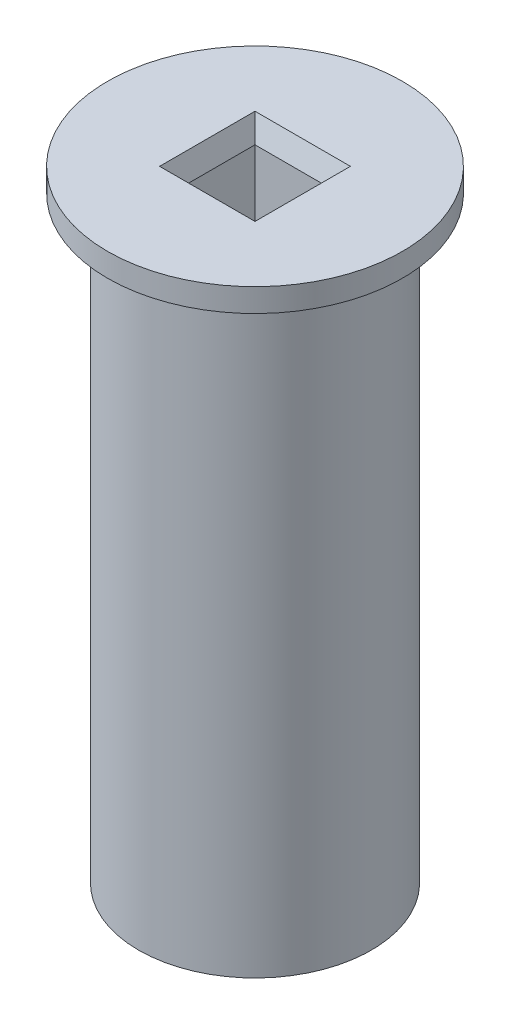
ISO-10303-21;
HEADER;
FILE_DESCRIPTION(('STEP AP214'),'2;1');
FILE_NAME('part.step','',(''),(''),'','','');
FILE_SCHEMA(('AUTOMOTIVE_DESIGN { 1 0 10303 214 1 1 1 1 }'));
ENDSEC;
DATA;
#1=APPLICATION_CONTEXT('core data for automotive mechanical design processes');
#2=APPLICATION_PROTOCOL_DEFINITION('international standard','automotive_design',2000,#1);
#3=PRODUCT_CONTEXT('',#1,'mechanical');
#4=PRODUCT('Part','Part','',(#3));
#5=PRODUCT_RELATED_PRODUCT_CATEGORY('part','',(#4));
#6=PRODUCT_DEFINITION_FORMATION('','',#4);
#7=PRODUCT_DEFINITION_CONTEXT('part definition',#1,'design');
#8=PRODUCT_DEFINITION('design','',#6,#7);
#9=PRODUCT_DEFINITION_SHAPE('','',#8);
#10=(LENGTH_UNIT() NAMED_UNIT(*) SI_UNIT(.MILLI.,.METRE.));
#11=(NAMED_UNIT(*) PLANE_ANGLE_UNIT() SI_UNIT($,.RADIAN.));
#12=(NAMED_UNIT(*) SI_UNIT($,.STERADIAN.) SOLID_ANGLE_UNIT());
#13=UNCERTAINTY_MEASURE_WITH_UNIT(LENGTH_MEASURE(1.E-05),#10,'distance_accuracy_value','');
#14=(GEOMETRIC_REPRESENTATION_CONTEXT(3) GLOBAL_UNCERTAINTY_ASSIGNED_CONTEXT((#13)) GLOBAL_UNIT_ASSIGNED_CONTEXT((#10,
#11,#12)) REPRESENTATION_CONTEXT('',''));
#15=CARTESIAN_POINT('',(0.,0.,0.));
#16=DIRECTION('',(0.,0.,1.));
#17=DIRECTION('',(1.,0.,0.));
#18=AXIS2_PLACEMENT_3D('',#15,#16,#17);
#19=CARTESIAN_POINT('',(0.,80.,0.));
#20=DIRECTION('',(0.,-1.,0.));
#21=DIRECTION('',(0.,0.,-1.));
#22=AXIS2_PLACEMENT_3D('',#19,#20,#21);
#23=CYLINDRICAL_SURFACE('',#22,15.);
#24=CARTESIAN_POINT('',(0.,0.,0.));
#25=DIRECTION('',(0.,1.,0.));
#26=DIRECTION('',(0.,0.,1.));
#27=AXIS2_PLACEMENT_3D('',#24,#25,#26);
#28=CIRCLE('',#27,15.);
#29=CARTESIAN_POINT('',(0.,0.,15.));
#30=VERTEX_POINT('',#29);
#31=EDGE_CURVE('E99',#30,#30,#28,.T.);
#32=ORIENTED_EDGE('',*,*,#31,.T.);
#33=EDGE_LOOP('',(#32));
#34=FACE_BOUND('',#33,.T.);
#35=CARTESIAN_POINT('',(0.,77.,0.));
#36=DIRECTION('',(0.,1.,0.));
#37=DIRECTION('',(0.,0.,1.));
#38=AXIS2_PLACEMENT_3D('',#35,#36,#37);
#39=CIRCLE('',#38,15.);
#40=CARTESIAN_POINT('',(0.,77.,15.));
#41=VERTEX_POINT('',#40);
#42=EDGE_CURVE('E121',#41,#41,#39,.T.);
#43=ORIENTED_EDGE('',*,*,#42,.F.);
#44=EDGE_LOOP('',(#43));
#45=FACE_BOUND('',#44,.T.);
#46=ADVANCED_FACE('F40',(#34,#45),#23,.T.);
#47=CARTESIAN_POINT('',(0.,80.,0.));
#48=DIRECTION('',(0.,1.,0.));
#49=DIRECTION('',(0.,0.,1.));
#50=AXIS2_PLACEMENT_3D('',#47,#48,#49);
#51=PLANE('',#50);
#52=DIRECTION('',(1.,0.,0.));
#53=VECTOR('',#52,1.);
#54=CARTESIAN_POINT('',(0.,80.,-6.14999999999999));
#55=LINE('',#54,#53);
#56=CARTESIAN_POINT('',(-6.14999999999999,80.,-6.14999999999999));
#57=VERTEX_POINT('',#56);
#58=CARTESIAN_POINT('',(6.15,80.,-6.14999999999999));
#59=VERTEX_POINT('',#58);
#60=EDGE_CURVE('E136',#57,#59,#55,.T.);
#61=ORIENTED_EDGE('',*,*,#60,.T.);
#62=DIRECTION('',(0.,0.,1.));
#63=VECTOR('',#62,1.);
#64=CARTESIAN_POINT('',(6.15,80.,0.));
#65=LINE('',#64,#63);
#66=CARTESIAN_POINT('',(6.15,80.,6.15));
#67=VERTEX_POINT('',#66);
#68=EDGE_CURVE('E142',#59,#67,#65,.T.);
#69=ORIENTED_EDGE('',*,*,#68,.T.);
#70=DIRECTION('',(-1.,0.,0.));
#71=VECTOR('',#70,1.);
#72=CARTESIAN_POINT('',(0.,80.,6.15));
#73=LINE('',#72,#71);
#74=CARTESIAN_POINT('',(-6.14999999999999,80.,6.15));
#75=VERTEX_POINT('',#74);
#76=EDGE_CURVE('E140',#67,#75,#73,.T.);
#77=ORIENTED_EDGE('',*,*,#76,.T.);
#78=DIRECTION('',(0.,0.,-1.));
#79=VECTOR('',#78,1.);
#80=CARTESIAN_POINT('',(-6.14999999999999,80.,0.));
#81=LINE('',#80,#79);
#82=EDGE_CURVE('E138',#75,#57,#81,.T.);
#83=ORIENTED_EDGE('',*,*,#82,.T.);
#84=EDGE_LOOP('',(#61,#69,#77,#83));
#85=FACE_BOUND('',#84,.T.);
#86=CARTESIAN_POINT('',(0.,80.,0.));
#87=DIRECTION('',(0.,1.,0.));
#88=DIRECTION('',(0.,0.,1.));
#89=AXIS2_PLACEMENT_3D('',#86,#87,#88);
#90=CIRCLE('',#89,19.);
#91=CARTESIAN_POINT('',(0.,80.,19.));
#92=VERTEX_POINT('',#91);
#93=EDGE_CURVE('E118',#92,#92,#90,.T.);
#94=ORIENTED_EDGE('',*,*,#93,.T.);
#95=EDGE_LOOP('',(#94));
#96=FACE_BOUND('',#95,.T.);
#97=ADVANCED_FACE('F163',(#85,#96),#51,.T.);
#98=CARTESIAN_POINT('',(0.,0.,0.));
#99=DIRECTION('',(0.,1.,0.));
#100=DIRECTION('',(0.,0.,1.));
#101=AXIS2_PLACEMENT_3D('',#98,#99,#100);
#102=PLANE('',#101);
#103=ORIENTED_EDGE('',*,*,#31,.F.);
#104=EDGE_LOOP('',(#103));
#105=FACE_BOUND('',#104,.T.);
#106=DIRECTION('',(0.,0.,1.));
#107=VECTOR('',#106,1.);
#108=CARTESIAN_POINT('',(-5.15,0.,5.15));
#109=LINE('',#108,#107);
#110=CARTESIAN_POINT('',(-5.15,0.,-5.15));
#111=VERTEX_POINT('',#110);
#112=CARTESIAN_POINT('',(-5.15,0.,5.15));
#113=VERTEX_POINT('',#112);
#114=EDGE_CURVE('E95',#111,#113,#109,.T.);
#115=ORIENTED_EDGE('',*,*,#114,.T.);
#116=DIRECTION('',(1.,0.,0.));
#117=VECTOR('',#116,1.);
#118=CARTESIAN_POINT('',(5.15,0.,5.15));
#119=LINE('',#118,#117);
#120=CARTESIAN_POINT('',(5.15,0.,5.15));
#121=VERTEX_POINT('',#120);
#122=EDGE_CURVE('E103',#113,#121,#119,.T.);
#123=ORIENTED_EDGE('',*,*,#122,.T.);
#124=DIRECTION('',(0.,0.,-1.));
#125=VECTOR('',#124,1.);
#126=CARTESIAN_POINT('',(5.15,0.,5.15));
#127=LINE('',#126,#125);
#128=CARTESIAN_POINT('',(5.15,0.,-5.15));
#129=VERTEX_POINT('',#128);
#130=EDGE_CURVE('E109',#121,#129,#127,.T.);
#131=ORIENTED_EDGE('',*,*,#130,.T.);
#132=DIRECTION('',(-1.,0.,0.));
#133=VECTOR('',#132,1.);
#134=CARTESIAN_POINT('',(5.15,0.,-5.15));
#135=LINE('',#134,#133);
#136=EDGE_CURVE('E113',#129,#111,#135,.T.);
#137=ORIENTED_EDGE('',*,*,#136,.T.);
#138=EDGE_LOOP('',(#115,#123,#131,#137));
#139=FACE_BOUND('',#138,.T.);
#140=ADVANCED_FACE('F111',(#105,#139),#102,.F.);
#141=CARTESIAN_POINT('',(-5.15,80.,5.15));
#142=DIRECTION('',(1.,0.,0.));
#143=DIRECTION('',(0.,0.,-1.));
#144=AXIS2_PLACEMENT_3D('',#141,#142,#143);
#145=PLANE('',#144);
#146=DIRECTION('',(0.,-1.,0.));
#147=VECTOR('',#146,1.);
#148=CARTESIAN_POINT('',(-5.15,80.,-5.15));
#149=LINE('',#148,#147);
#150=CARTESIAN_POINT('',(-5.15,77.2525225805454,-5.15));
#151=VERTEX_POINT('',#150);
#152=EDGE_CURVE('E126',#151,#111,#149,.T.);
#153=ORIENTED_EDGE('',*,*,#152,.F.);
#154=DIRECTION('',(0.,0.,1.));
#155=VECTOR('',#154,1.);
#156=CARTESIAN_POINT('',(-5.15,77.2525225805454,5.15));
#157=LINE('',#156,#155);
#158=CARTESIAN_POINT('',(-5.15,77.2525225805454,5.15));
#159=VERTEX_POINT('',#158);
#160=EDGE_CURVE('E49',#151,#159,#157,.T.);
#161=ORIENTED_EDGE('',*,*,#160,.T.);
#162=DIRECTION('',(0.,-1.,0.));
#163=VECTOR('',#162,1.);
#164=CARTESIAN_POINT('',(-5.15,80.,5.15));
#165=LINE('',#164,#163);
#166=EDGE_CURVE('E91',#159,#113,#165,.T.);
#167=ORIENTED_EDGE('',*,*,#166,.T.);
#168=ORIENTED_EDGE('',*,*,#114,.F.);
#169=EDGE_LOOP('',(#153,#161,#167,#168));
#170=FACE_BOUND('',#169,.T.);
#171=ADVANCED_FACE('F93',(#170),#145,.T.);
#172=CARTESIAN_POINT('',(5.15,80.,5.15));
#173=DIRECTION('',(0.,0.,-1.));
#174=DIRECTION('',(-1.,0.,0.));
#175=AXIS2_PLACEMENT_3D('',#172,#173,#174);
#176=PLANE('',#175);
#177=ORIENTED_EDGE('',*,*,#166,.F.);
#178=DIRECTION('',(1.,0.,0.));
#179=VECTOR('',#178,1.);
#180=CARTESIAN_POINT('',(5.15,77.2525225805454,5.15));
#181=LINE('',#180,#179);
#182=CARTESIAN_POINT('',(5.15,77.2525225805454,5.15));
#183=VERTEX_POINT('',#182);
#184=EDGE_CURVE('E145',#159,#183,#181,.T.);
#185=ORIENTED_EDGE('',*,*,#184,.T.);
#186=DIRECTION('',(0.,-1.,0.));
#187=VECTOR('',#186,1.);
#188=CARTESIAN_POINT('',(5.15,80.,5.15));
#189=LINE('',#188,#187);
#190=EDGE_CURVE('E100',#183,#121,#189,.T.);
#191=ORIENTED_EDGE('',*,*,#190,.T.);
#192=ORIENTED_EDGE('',*,*,#122,.F.);
#193=EDGE_LOOP('',(#177,#185,#191,#192));
#194=FACE_BOUND('',#193,.T.);
#195=ADVANCED_FACE('F104',(#194),#176,.T.);
#196=CARTESIAN_POINT('',(5.15,80.,5.15));
#197=DIRECTION('',(-1.,0.,0.));
#198=DIRECTION('',(0.,0.,1.));
#199=AXIS2_PLACEMENT_3D('',#196,#197,#198);
#200=PLANE('',#199);
#201=ORIENTED_EDGE('',*,*,#190,.F.);
#202=DIRECTION('',(0.,0.,-1.));
#203=VECTOR('',#202,1.);
#204=CARTESIAN_POINT('',(5.15,77.2525225805454,5.15));
#205=LINE('',#204,#203);
#206=CARTESIAN_POINT('',(5.15,77.2525225805454,-5.15));
#207=VERTEX_POINT('',#206);
#208=EDGE_CURVE('E133',#183,#207,#205,.T.);
#209=ORIENTED_EDGE('',*,*,#208,.T.);
#210=DIRECTION('',(0.,-1.,0.));
#211=VECTOR('',#210,1.);
#212=CARTESIAN_POINT('',(5.15,80.,-5.15));
#213=LINE('',#212,#211);
#214=EDGE_CURVE('E128',#207,#129,#213,.T.);
#215=ORIENTED_EDGE('',*,*,#214,.T.);
#216=ORIENTED_EDGE('',*,*,#130,.F.);
#217=EDGE_LOOP('',(#201,#209,#215,#216));
#218=FACE_BOUND('',#217,.T.);
#219=ADVANCED_FACE('F254',(#218),#200,.T.);
#220=CARTESIAN_POINT('',(5.15,80.,-5.15));
#221=DIRECTION('',(0.,0.,1.));
#222=DIRECTION('',(1.,0.,0.));
#223=AXIS2_PLACEMENT_3D('',#220,#221,#222);
#224=PLANE('',#223);
#225=ORIENTED_EDGE('',*,*,#214,.F.);
#226=DIRECTION('',(-1.,0.,0.));
#227=VECTOR('',#226,1.);
#228=CARTESIAN_POINT('',(5.15,77.2525225805454,-5.15));
#229=LINE('',#228,#227);
#230=EDGE_CURVE('E11',#207,#151,#229,.T.);
#231=ORIENTED_EDGE('',*,*,#230,.T.);
#232=ORIENTED_EDGE('',*,*,#152,.T.);
#233=ORIENTED_EDGE('',*,*,#136,.F.);
#234=EDGE_LOOP('',(#225,#231,#232,#233));
#235=FACE_BOUND('',#234,.T.);
#236=ADVANCED_FACE('F176',(#235),#224,.T.);
#237=CARTESIAN_POINT('',(0.,77.,0.));
#238=DIRECTION('',(0.,1.,0.));
#239=DIRECTION('',(0.,0.,1.));
#240=AXIS2_PLACEMENT_3D('',#237,#238,#239);
#241=PLANE('',#240);
#242=CARTESIAN_POINT('',(0.,77.,0.));
#243=DIRECTION('',(0.,1.,0.));
#244=DIRECTION('',(0.,0.,1.));
#245=AXIS2_PLACEMENT_3D('',#242,#243,#244);
#246=CIRCLE('',#245,19.);
#247=CARTESIAN_POINT('',(0.,77.,19.));
#248=VERTEX_POINT('',#247);
#249=EDGE_CURVE('E114',#248,#248,#246,.T.);
#250=ORIENTED_EDGE('',*,*,#249,.F.);
#251=EDGE_LOOP('',(#250));
#252=FACE_BOUND('',#251,.T.);
#253=ORIENTED_EDGE('',*,*,#42,.T.);
#254=EDGE_LOOP('',(#253));
#255=FACE_BOUND('',#254,.T.);
#256=ADVANCED_FACE('F167',(#252,#255),#241,.F.);
#257=CARTESIAN_POINT('',(0.,77.,0.));
#258=DIRECTION('',(0.,1.,0.));
#259=DIRECTION('',(0.,0.,1.));
#260=AXIS2_PLACEMENT_3D('',#257,#258,#259);
#261=CYLINDRICAL_SURFACE('',#260,19.);
#262=ORIENTED_EDGE('',*,*,#249,.T.);
#263=EDGE_LOOP('',(#262));
#264=FACE_BOUND('',#263,.T.);
#265=ORIENTED_EDGE('',*,*,#93,.F.);
#266=EDGE_LOOP('',(#265));
#267=FACE_BOUND('',#266,.T.);
#268=ADVANCED_FACE('F165',(#264,#267),#261,.T.);
#269=CARTESIAN_POINT('',(-5.15,77.2525225805454,5.15));
#270=DIRECTION('',(-0.939692620785909,-0.342020143325667,0.));
#271=DIRECTION('',(0.,0.,1.));
#272=AXIS2_PLACEMENT_3D('',#269,#270,#271);
#273=PLANE('',#272);
#274=DIRECTION('',(0.323615577118183,-0.889126490715989,0.323615577118183));
#275=VECTOR('',#274,1.);
#276=CARTESIAN_POINT('',(-4.07131146993859,74.2888502015769,-4.07131146993859));
#277=LINE('',#276,#275);
#278=EDGE_CURVE('E151',#57,#151,#277,.T.);
#279=ORIENTED_EDGE('',*,*,#278,.F.);
#280=ORIENTED_EDGE('',*,*,#82,.F.);
#281=DIRECTION('',(0.323615577118183,-0.889126490715989,-0.323615577118183));
#282=VECTOR('',#281,1.);
#283=CARTESIAN_POINT('',(-4.07131146993859,74.2888502015769,4.07131146993859));
#284=LINE('',#283,#282);
#285=EDGE_CURVE('E44',#159,#75,#284,.F.);
#286=ORIENTED_EDGE('',*,*,#285,.F.);
#287=ORIENTED_EDGE('',*,*,#160,.F.);
#288=EDGE_LOOP('',(#279,#280,#286,#287));
#289=FACE_BOUND('',#288,.T.);
#290=ADVANCED_FACE('F42',(#289),#273,.F.);
#291=CARTESIAN_POINT('',(5.15,77.2525225805454,5.15));
#292=DIRECTION('',(0.,-0.342020143325667,0.939692620785909));
#293=DIRECTION('',(1.,0.,0.));
#294=AXIS2_PLACEMENT_3D('',#291,#292,#293);
#295=PLANE('',#294);
#296=ORIENTED_EDGE('',*,*,#285,.T.);
#297=ORIENTED_EDGE('',*,*,#76,.F.);
#298=DIRECTION('',(-0.323615577118183,-0.889126490715989,-0.323615577118183));
#299=VECTOR('',#298,1.);
#300=CARTESIAN_POINT('',(5.15,77.2525225805454,5.15));
#301=LINE('',#300,#299);
#302=EDGE_CURVE('E150',#183,#67,#301,.F.);
#303=ORIENTED_EDGE('',*,*,#302,.F.);
#304=ORIENTED_EDGE('',*,*,#184,.F.);
#305=EDGE_LOOP('',(#296,#297,#303,#304));
#306=FACE_BOUND('',#305,.T.);
#307=ADVANCED_FACE('F174',(#306),#295,.F.);
#308=CARTESIAN_POINT('',(5.15,77.2525225805454,-5.15));
#309=DIRECTION('',(0.,-0.342020143325667,-0.939692620785909));
#310=DIRECTION('',(-1.,0.,0.));
#311=AXIS2_PLACEMENT_3D('',#308,#309,#310);
#312=PLANE('',#311);
#313=ORIENTED_EDGE('',*,*,#278,.T.);
#314=ORIENTED_EDGE('',*,*,#230,.F.);
#315=DIRECTION('',(0.323615577118183,0.889126490715989,-0.323615577118183));
#316=VECTOR('',#315,1.);
#317=CARTESIAN_POINT('',(4.07131146993859,74.2888502015769,-4.07131146993859));
#318=LINE('',#317,#316);
#319=EDGE_CURVE('E148',#59,#207,#318,.F.);
#320=ORIENTED_EDGE('',*,*,#319,.F.);
#321=ORIENTED_EDGE('',*,*,#60,.F.);
#322=EDGE_LOOP('',(#313,#314,#320,#321));
#323=FACE_BOUND('',#322,.T.);
#324=ADVANCED_FACE('F194',(#323),#312,.F.);
#325=CARTESIAN_POINT('',(5.15,77.2525225805454,5.15));
#326=DIRECTION('',(0.939692620785909,-0.342020143325667,0.));
#327=DIRECTION('',(0.,0.,-1.));
#328=AXIS2_PLACEMENT_3D('',#325,#326,#327);
#329=PLANE('',#328);
#330=ORIENTED_EDGE('',*,*,#302,.T.);
#331=ORIENTED_EDGE('',*,*,#68,.F.);
#332=ORIENTED_EDGE('',*,*,#319,.T.);
#333=ORIENTED_EDGE('',*,*,#208,.F.);
#334=EDGE_LOOP('',(#330,#331,#332,#333));
#335=FACE_BOUND('',#334,.T.);
#336=ADVANCED_FACE('F191',(#335),#329,.F.);
#337=CLOSED_SHELL('',(#46,#97,#140,#171,#195,#219,#236,#256,#268,#290,#307,#324,#336));
#338=MANIFOLD_SOLID_BREP('B2',#337);
#339=ADVANCED_BREP_SHAPE_REPRESENTATION('',(#18,#338),#14);
#340=SHAPE_DEFINITION_REPRESENTATION(#9,#339);
ENDSEC;
END-ISO-10303-21;
